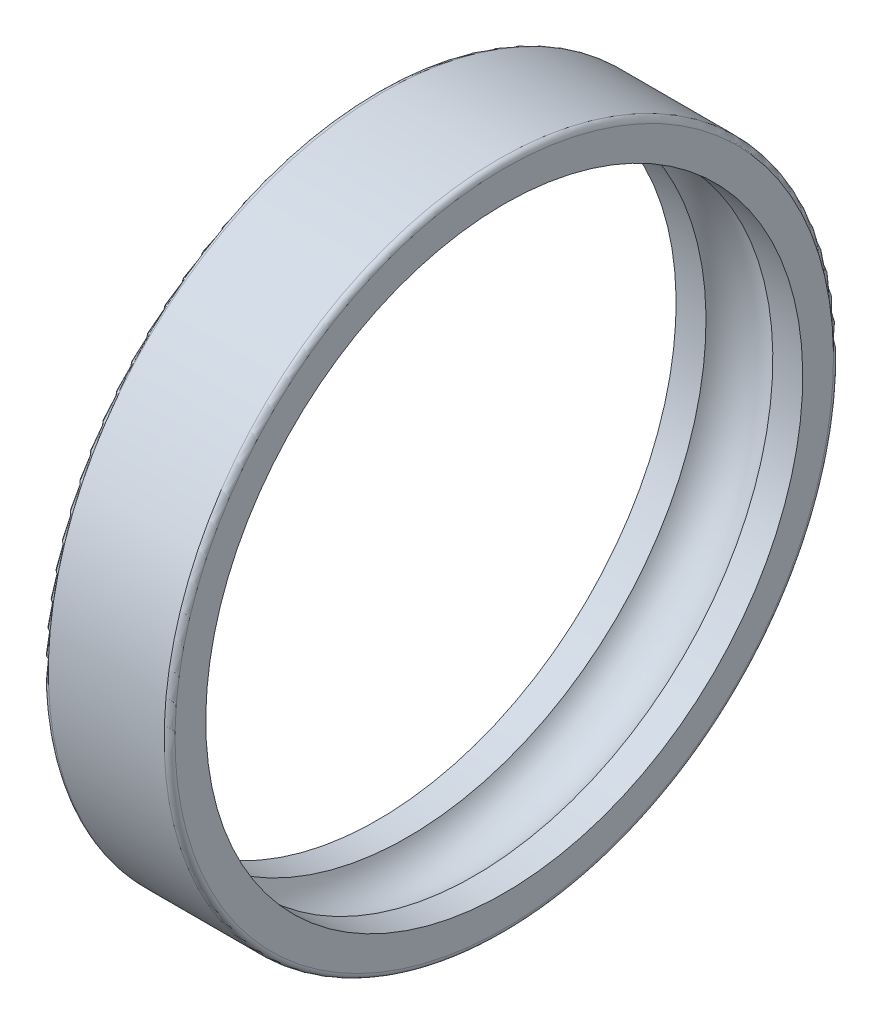
ISO-10303-21;
HEADER;
FILE_DESCRIPTION(('STEP AP214'),'2;1');
FILE_NAME('part.step','',(''),(''),'','','');
FILE_SCHEMA(('AUTOMOTIVE_DESIGN { 1 0 10303 214 1 1 1 1 }'));
ENDSEC;
DATA;
#1=APPLICATION_CONTEXT('core data for automotive mechanical design processes');
#2=APPLICATION_PROTOCOL_DEFINITION('international standard','automotive_design',2000,#1);
#3=PRODUCT_CONTEXT('',#1,'mechanical');
#4=PRODUCT('Part','Part','',(#3));
#5=PRODUCT_RELATED_PRODUCT_CATEGORY('part','',(#4));
#6=PRODUCT_DEFINITION_FORMATION('','',#4);
#7=PRODUCT_DEFINITION_CONTEXT('part definition',#1,'design');
#8=PRODUCT_DEFINITION('design','',#6,#7);
#9=PRODUCT_DEFINITION_SHAPE('','',#8);
#10=(LENGTH_UNIT() NAMED_UNIT(*) SI_UNIT(.MILLI.,.METRE.));
#11=(NAMED_UNIT(*) PLANE_ANGLE_UNIT() SI_UNIT($,.RADIAN.));
#12=(NAMED_UNIT(*) SI_UNIT($,.STERADIAN.) SOLID_ANGLE_UNIT());
#13=UNCERTAINTY_MEASURE_WITH_UNIT(LENGTH_MEASURE(1.E-05),#10,'distance_accuracy_value','');
#14=(GEOMETRIC_REPRESENTATION_CONTEXT(3) GLOBAL_UNCERTAINTY_ASSIGNED_CONTEXT((#13)) GLOBAL_UNIT_ASSIGNED_CONTEXT((#10,
#11,#12)) REPRESENTATION_CONTEXT('',''));
#15=CARTESIAN_POINT('',(0.,0.,0.));
#16=DIRECTION('',(0.,0.,1.));
#17=DIRECTION('',(1.,0.,0.));
#18=AXIS2_PLACEMENT_3D('',#15,#16,#17);
#19=CARTESIAN_POINT('',(0.,0.,0.));
#20=DIRECTION('',(1.,0.,0.));
#21=DIRECTION('',(0.,0.,-1.));
#22=AXIS2_PLACEMENT_3D('',#19,#20,#21);
#23=TOROIDAL_SURFACE('',#22,15.5,2.1);
#24=CARTESIAN_POINT('',(1.84661853126194,0.,0.));
#25=DIRECTION('',(1.,0.,0.));
#26=DIRECTION('',(0.,1.,0.));
#27=AXIS2_PLACEMENT_3D('',#24,#25,#26);
#28=CIRCLE('',#27,16.5);
#29=CARTESIAN_POINT('',(1.84661853126194,16.5,0.));
#30=VERTEX_POINT('',#29);
#31=EDGE_CURVE('E11',#30,#30,#28,.T.);
#32=ORIENTED_EDGE('',*,*,#31,.T.);
#33=EDGE_LOOP('',(#32));
#34=FACE_BOUND('',#33,.T.);
#35=CARTESIAN_POINT('',(-1.84661853126194,0.,0.));
#36=DIRECTION('',(1.,0.,0.));
#37=DIRECTION('',(0.,1.,0.));
#38=AXIS2_PLACEMENT_3D('',#35,#36,#37);
#39=CIRCLE('',#38,16.5);
#40=CARTESIAN_POINT('',(-1.84661853126194,16.5,0.));
#41=VERTEX_POINT('',#40);
#42=EDGE_CURVE('E65',#41,#41,#39,.T.);
#43=ORIENTED_EDGE('',*,*,#42,.F.);
#44=EDGE_LOOP('',(#43));
#45=FACE_BOUND('',#44,.T.);
#46=ADVANCED_FACE('F17',(#34,#45),#23,.F.);
#47=CARTESIAN_POINT('',(2.67330926563097,0.,0.));
#48=DIRECTION('',(-1.,0.,0.));
#49=DIRECTION('',(0.,1.,0.));
#50=AXIS2_PLACEMENT_3D('',#47,#48,#49);
#51=CYLINDRICAL_SURFACE('',#50,16.5);
#52=CARTESIAN_POINT('',(3.5,0.,0.));
#53=DIRECTION('',(1.,0.,0.));
#54=DIRECTION('',(0.,1.,0.));
#55=AXIS2_PLACEMENT_3D('',#52,#53,#54);
#56=CIRCLE('',#55,16.5);
#57=CARTESIAN_POINT('',(3.5,16.5,0.));
#58=VERTEX_POINT('',#57);
#59=EDGE_CURVE('E27',#58,#58,#56,.T.);
#60=ORIENTED_EDGE('',*,*,#59,.T.);
#61=EDGE_LOOP('',(#60));
#62=FACE_BOUND('',#61,.T.);
#63=ORIENTED_EDGE('',*,*,#31,.F.);
#64=EDGE_LOOP('',(#63));
#65=FACE_BOUND('',#64,.T.);
#66=ADVANCED_FACE('F75',(#62,#65),#51,.F.);
#67=CARTESIAN_POINT('',(3.5,17.35,0.));
#68=DIRECTION('',(1.,0.,0.));
#69=DIRECTION('',(0.,1.,0.));
#70=AXIS2_PLACEMENT_3D('',#67,#68,#69);
#71=PLANE('',#70);
#72=CARTESIAN_POINT('',(3.5,0.,0.));
#73=DIRECTION('',(1.,0.,0.));
#74=DIRECTION('',(0.,1.,0.));
#75=AXIS2_PLACEMENT_3D('',#72,#73,#74);
#76=CIRCLE('',#75,18.2);
#77=CARTESIAN_POINT('',(3.5,18.2,0.));
#78=VERTEX_POINT('',#77);
#79=EDGE_CURVE('E57',#78,#78,#76,.T.);
#80=ORIENTED_EDGE('',*,*,#79,.T.);
#81=EDGE_LOOP('',(#80));
#82=FACE_BOUND('',#81,.T.);
#83=ORIENTED_EDGE('',*,*,#59,.F.);
#84=EDGE_LOOP('',(#83));
#85=FACE_BOUND('',#84,.T.);
#86=ADVANCED_FACE('F58',(#82,#85),#71,.T.);
#87=CARTESIAN_POINT('',(3.2,0.,0.));
#88=DIRECTION('',(1.,0.,0.));
#89=DIRECTION('',(0.,0.,-1.));
#90=AXIS2_PLACEMENT_3D('',#87,#88,#89);
#91=TOROIDAL_SURFACE('',#90,18.2,0.3);
#92=CARTESIAN_POINT('',(3.2,0.,0.));
#93=DIRECTION('',(1.,0.,0.));
#94=DIRECTION('',(0.,1.,0.));
#95=AXIS2_PLACEMENT_3D('',#92,#93,#94);
#96=CIRCLE('',#95,18.5);
#97=CARTESIAN_POINT('',(3.2,18.5,0.));
#98=VERTEX_POINT('',#97);
#99=EDGE_CURVE('E61',#98,#98,#96,.T.);
#100=ORIENTED_EDGE('',*,*,#99,.T.);
#101=EDGE_LOOP('',(#100));
#102=FACE_BOUND('',#101,.T.);
#103=ORIENTED_EDGE('',*,*,#79,.F.);
#104=EDGE_LOOP('',(#103));
#105=FACE_BOUND('',#104,.T.);
#106=ADVANCED_FACE('F89',(#102,#105),#91,.T.);
#107=CARTESIAN_POINT('',(0.,0.,0.));
#108=DIRECTION('',(-1.,0.,0.));
#109=DIRECTION('',(0.,1.,0.));
#110=AXIS2_PLACEMENT_3D('',#107,#108,#109);
#111=CYLINDRICAL_SURFACE('',#110,18.5);
#112=CARTESIAN_POINT('',(-3.2,0.,0.));
#113=DIRECTION('',(1.,0.,0.));
#114=DIRECTION('',(0.,1.,0.));
#115=AXIS2_PLACEMENT_3D('',#112,#113,#114);
#116=CIRCLE('',#115,18.5);
#117=CARTESIAN_POINT('',(-3.2,18.5,0.));
#118=VERTEX_POINT('',#117);
#119=EDGE_CURVE('E21',#118,#118,#116,.T.);
#120=ORIENTED_EDGE('',*,*,#119,.T.);
#121=EDGE_LOOP('',(#120));
#122=FACE_BOUND('',#121,.T.);
#123=ORIENTED_EDGE('',*,*,#99,.F.);
#124=EDGE_LOOP('',(#123));
#125=FACE_BOUND('',#124,.T.);
#126=ADVANCED_FACE('F19',(#122,#125),#111,.T.);
#127=CARTESIAN_POINT('',(-3.2,0.,0.));
#128=DIRECTION('',(1.,0.,0.));
#129=DIRECTION('',(0.,0.,-1.));
#130=AXIS2_PLACEMENT_3D('',#127,#128,#129);
#131=TOROIDAL_SURFACE('',#130,18.2,0.3);
#132=CARTESIAN_POINT('',(-3.5,0.,0.));
#133=DIRECTION('',(1.,0.,0.));
#134=DIRECTION('',(0.,1.,0.));
#135=AXIS2_PLACEMENT_3D('',#132,#133,#134);
#136=CIRCLE('',#135,18.2);
#137=CARTESIAN_POINT('',(-3.5,18.2,0.));
#138=VERTEX_POINT('',#137);
#139=EDGE_CURVE('E51',#138,#138,#136,.T.);
#140=ORIENTED_EDGE('',*,*,#139,.T.);
#141=EDGE_LOOP('',(#140));
#142=FACE_BOUND('',#141,.T.);
#143=ORIENTED_EDGE('',*,*,#119,.F.);
#144=EDGE_LOOP('',(#143));
#145=FACE_BOUND('',#144,.T.);
#146=ADVANCED_FACE('F85',(#142,#145),#131,.T.);
#147=CARTESIAN_POINT('',(-3.5,17.35,0.));
#148=DIRECTION('',(-1.,0.,0.));
#149=DIRECTION('',(0.,-1.,0.));
#150=AXIS2_PLACEMENT_3D('',#147,#148,#149);
#151=PLANE('',#150);
#152=CARTESIAN_POINT('',(-3.5,0.,0.));
#153=DIRECTION('',(1.,0.,0.));
#154=DIRECTION('',(0.,1.,0.));
#155=AXIS2_PLACEMENT_3D('',#152,#153,#154);
#156=CIRCLE('',#155,16.5);
#157=CARTESIAN_POINT('',(-3.5,16.5,0.));
#158=VERTEX_POINT('',#157);
#159=EDGE_CURVE('E67',#158,#158,#156,.T.);
#160=ORIENTED_EDGE('',*,*,#159,.T.);
#161=EDGE_LOOP('',(#160));
#162=FACE_BOUND('',#161,.T.);
#163=ORIENTED_EDGE('',*,*,#139,.F.);
#164=EDGE_LOOP('',(#163));
#165=FACE_BOUND('',#164,.T.);
#166=ADVANCED_FACE('F87',(#162,#165),#151,.T.);
#167=CARTESIAN_POINT('',(-2.67330926563097,0.,0.));
#168=DIRECTION('',(-1.,0.,0.));
#169=DIRECTION('',(0.,1.,0.));
#170=AXIS2_PLACEMENT_3D('',#167,#168,#169);
#171=CYLINDRICAL_SURFACE('',#170,16.5);
#172=ORIENTED_EDGE('',*,*,#42,.T.);
#173=EDGE_LOOP('',(#172));
#174=FACE_BOUND('',#173,.T.);
#175=ORIENTED_EDGE('',*,*,#159,.F.);
#176=EDGE_LOOP('',(#175));
#177=FACE_BOUND('',#176,.T.);
#178=ADVANCED_FACE('F71',(#174,#177),#171,.F.);
#179=CLOSED_SHELL('',(#46,#66,#86,#106,#126,#146,#166,#178));
#180=MANIFOLD_SOLID_BREP('B1',#179);
#181=ADVANCED_BREP_SHAPE_REPRESENTATION('',(#18,#180),#14);
#182=SHAPE_DEFINITION_REPRESENTATION(#9,#181);
ENDSEC;
END-ISO-10303-21;
